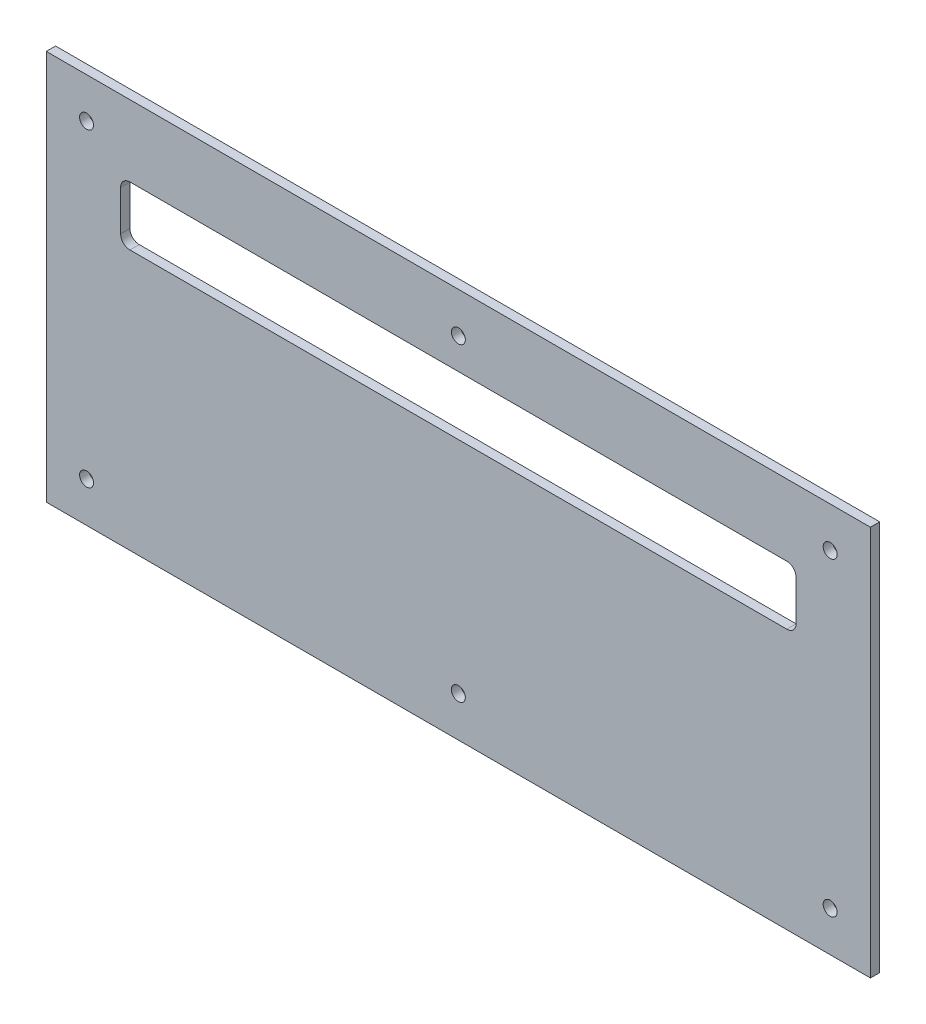
ISO-10303-21;
HEADER;
FILE_DESCRIPTION(('STEP AP214'),'2;1');
FILE_NAME('part.step','',(''),(''),'','','');
FILE_SCHEMA(('AUTOMOTIVE_DESIGN { 1 0 10303 214 1 1 1 1 }'));
ENDSEC;
DATA;
#1=APPLICATION_CONTEXT('core data for automotive mechanical design processes');
#2=APPLICATION_PROTOCOL_DEFINITION('international standard','automotive_design',2000,#1);
#3=PRODUCT_CONTEXT('',#1,'mechanical');
#4=PRODUCT('Part','Part','',(#3));
#5=PRODUCT_RELATED_PRODUCT_CATEGORY('part','',(#4));
#6=PRODUCT_DEFINITION_FORMATION('','',#4);
#7=PRODUCT_DEFINITION_CONTEXT('part definition',#1,'design');
#8=PRODUCT_DEFINITION('design','',#6,#7);
#9=PRODUCT_DEFINITION_SHAPE('','',#8);
#10=(LENGTH_UNIT() NAMED_UNIT(*) SI_UNIT(.MILLI.,.METRE.));
#11=(NAMED_UNIT(*) PLANE_ANGLE_UNIT() SI_UNIT($,.RADIAN.));
#12=(NAMED_UNIT(*) SI_UNIT($,.STERADIAN.) SOLID_ANGLE_UNIT());
#13=UNCERTAINTY_MEASURE_WITH_UNIT(LENGTH_MEASURE(1.E-05),#10,'distance_accuracy_value','');
#14=(GEOMETRIC_REPRESENTATION_CONTEXT(3) GLOBAL_UNCERTAINTY_ASSIGNED_CONTEXT((#13)) GLOBAL_UNIT_ASSIGNED_CONTEXT((#10,
#11,#12)) REPRESENTATION_CONTEXT('',''));
#15=CARTESIAN_POINT('',(0.,0.,0.));
#16=DIRECTION('',(0.,0.,1.));
#17=DIRECTION('',(1.,0.,0.));
#18=AXIS2_PLACEMENT_3D('',#15,#16,#17);
#19=CARTESIAN_POINT('',(23.,123.,-3.00000000000001));
#20=DIRECTION('',(-1.,0.,0.));
#21=DIRECTION('',(0.,0.,1.));
#22=AXIS2_PLACEMENT_3D('',#19,#20,#21);
#23=PLANE('',#22);
#24=DIRECTION('',(0.,-1.,0.));
#25=VECTOR('',#24,1.);
#26=CARTESIAN_POINT('',(23.,123.,0.));
#27=LINE('',#26,#25);
#28=CARTESIAN_POINT('',(23.,123.,0.));
#29=VERTEX_POINT('',#28);
#30=CARTESIAN_POINT('',(23.,-2.99999999999886,0.));
#31=VERTEX_POINT('',#30);
#32=EDGE_CURVE('E146',#29,#31,#27,.T.);
#33=ORIENTED_EDGE('',*,*,#32,.T.);
#34=DIRECTION('',(0.,0.,1.));
#35=VECTOR('',#34,1.);
#36=CARTESIAN_POINT('',(23.,-2.99999999999886,-3.00000000000001));
#37=LINE('',#36,#35);
#38=CARTESIAN_POINT('',(23.,-2.99999999999886,-3.00000000000001));
#39=VERTEX_POINT('',#38);
#40=EDGE_CURVE('E127',#39,#31,#37,.T.);
#41=ORIENTED_EDGE('',*,*,#40,.F.);
#42=DIRECTION('',(0.,-1.,0.));
#43=VECTOR('',#42,1.);
#44=CARTESIAN_POINT('',(23.,123.,-3.00000000000001));
#45=LINE('',#44,#43);
#46=CARTESIAN_POINT('',(23.,123.,-3.00000000000001));
#47=VERTEX_POINT('',#46);
#48=EDGE_CURVE('E134',#47,#39,#45,.T.);
#49=ORIENTED_EDGE('',*,*,#48,.F.);
#50=DIRECTION('',(0.,0.,1.));
#51=VECTOR('',#50,1.);
#52=CARTESIAN_POINT('',(23.,123.,-3.00000000000001));
#53=LINE('',#52,#51);
#54=EDGE_CURVE('E217',#47,#29,#53,.T.);
#55=ORIENTED_EDGE('',*,*,#54,.T.);
#56=EDGE_LOOP('',(#33,#41,#49,#55));
#57=FACE_BOUND('',#56,.T.);
#58=ADVANCED_FACE('F33',(#57),#23,.F.);
#59=CARTESIAN_POINT('',(23.,-2.99999999999886,-3.00000000000001));
#60=DIRECTION('',(0.,1.,0.));
#61=DIRECTION('',(-1.,0.,0.));
#62=AXIS2_PLACEMENT_3D('',#59,#60,#61);
#63=PLANE('',#62);
#64=DIRECTION('',(-1.,0.,0.));
#65=VECTOR('',#64,1.);
#66=CARTESIAN_POINT('',(23.,-2.99999999999886,0.));
#67=LINE('',#66,#65);
#68=CARTESIAN_POINT('',(-243.,-2.99999999999923,1.14860437237702E-13));
#69=VERTEX_POINT('',#68);
#70=EDGE_CURVE('E219',#31,#69,#67,.T.);
#71=ORIENTED_EDGE('',*,*,#70,.T.);
#72=DIRECTION('',(0.,0.,1.));
#73=VECTOR('',#72,1.);
#74=CARTESIAN_POINT('',(-243.,-2.99999999999923,-2.99999999999988));
#75=LINE('',#74,#73);
#76=CARTESIAN_POINT('',(-243.,-2.99999999999923,-2.99999999999988));
#77=VERTEX_POINT('',#76);
#78=EDGE_CURVE('E130',#77,#69,#75,.T.);
#79=ORIENTED_EDGE('',*,*,#78,.F.);
#80=DIRECTION('',(-1.,0.,0.));
#81=VECTOR('',#80,1.);
#82=CARTESIAN_POINT('',(23.,-2.99999999999886,-3.00000000000001));
#83=LINE('',#82,#81);
#84=EDGE_CURVE('E123',#39,#77,#83,.T.);
#85=ORIENTED_EDGE('',*,*,#84,.F.);
#86=ORIENTED_EDGE('',*,*,#40,.T.);
#87=EDGE_LOOP('',(#71,#79,#85,#86));
#88=FACE_BOUND('',#87,.T.);
#89=ADVANCED_FACE('F125',(#88),#63,.F.);
#90=CARTESIAN_POINT('',(-243.,123.,-2.99999999999988));
#91=DIRECTION('',(1.,0.,0.));
#92=DIRECTION('',(0.,1.,0.));
#93=AXIS2_PLACEMENT_3D('',#90,#91,#92);
#94=PLANE('',#93);
#95=DIRECTION('',(0.,1.,0.));
#96=VECTOR('',#95,1.);
#97=CARTESIAN_POINT('',(-243.,123.,1.14860437237702E-13));
#98=LINE('',#97,#96);
#99=CARTESIAN_POINT('',(-243.,123.,1.14860437237702E-13));
#100=VERTEX_POINT('',#99);
#101=EDGE_CURVE('E221',#69,#100,#98,.T.);
#102=ORIENTED_EDGE('',*,*,#101,.T.);
#103=DIRECTION('',(0.,0.,1.));
#104=VECTOR('',#103,1.);
#105=CARTESIAN_POINT('',(-243.,123.,-2.99999999999988));
#106=LINE('',#105,#104);
#107=CARTESIAN_POINT('',(-243.,123.,-2.99999999999988));
#108=VERTEX_POINT('',#107);
#109=EDGE_CURVE('E152',#108,#100,#106,.T.);
#110=ORIENTED_EDGE('',*,*,#109,.F.);
#111=DIRECTION('',(0.,1.,0.));
#112=VECTOR('',#111,1.);
#113=CARTESIAN_POINT('',(-243.,123.,-2.99999999999988));
#114=LINE('',#113,#112);
#115=EDGE_CURVE('E133',#77,#108,#114,.T.);
#116=ORIENTED_EDGE('',*,*,#115,.F.);
#117=ORIENTED_EDGE('',*,*,#78,.T.);
#118=EDGE_LOOP('',(#102,#110,#116,#117));
#119=FACE_BOUND('',#118,.T.);
#120=ADVANCED_FACE('F231',(#119),#94,.F.);
#121=CARTESIAN_POINT('',(23.,123.,-3.00000000000001));
#122=DIRECTION('',(0.,-1.,0.));
#123=DIRECTION('',(0.,0.,-1.));
#124=AXIS2_PLACEMENT_3D('',#121,#122,#123);
#125=PLANE('',#124);
#126=DIRECTION('',(1.,0.,0.));
#127=VECTOR('',#126,1.);
#128=CARTESIAN_POINT('',(23.,123.,0.));
#129=LINE('',#128,#127);
#130=EDGE_CURVE('E143',#100,#29,#129,.T.);
#131=ORIENTED_EDGE('',*,*,#130,.T.);
#132=ORIENTED_EDGE('',*,*,#54,.F.);
#133=DIRECTION('',(1.,0.,0.));
#134=VECTOR('',#133,1.);
#135=CARTESIAN_POINT('',(23.,123.,-3.00000000000001));
#136=LINE('',#135,#134);
#137=EDGE_CURVE('E139',#108,#47,#136,.T.);
#138=ORIENTED_EDGE('',*,*,#137,.F.);
#139=ORIENTED_EDGE('',*,*,#109,.T.);
#140=EDGE_LOOP('',(#131,#132,#138,#139));
#141=FACE_BOUND('',#140,.T.);
#142=ADVANCED_FACE('F228',(#141),#125,.F.);
#143=CARTESIAN_POINT('',(0.,0.,-3.));
#144=DIRECTION('',(0.,0.,-1.));
#145=DIRECTION('',(-1.,0.,0.));
#146=AXIS2_PLACEMENT_3D('',#143,#144,#145);
#147=PLANE('',#146);
#148=CARTESIAN_POINT('',(-230.,10.0000000000008,-2.99999999999989));
#149=DIRECTION('',(0.,0.,-1.));
#150=DIRECTION('',(-1.,0.,0.));
#151=AXIS2_PLACEMENT_3D('',#148,#149,#150);
#152=CIRCLE('',#151,2.24999999999995);
#153=CARTESIAN_POINT('',(-232.25,10.0000000000008,-2.99999999999989));
#154=VERTEX_POINT('',#153);
#155=EDGE_CURVE('E307',#154,#154,#152,.T.);
#156=ORIENTED_EDGE('',*,*,#155,.F.);
#157=EDGE_LOOP('',(#156));
#158=FACE_BOUND('',#157,.T.);
#159=CARTESIAN_POINT('',(-110.,10.0000000000008,-2.99999999999995));
#160=DIRECTION('',(0.,0.,-1.));
#161=DIRECTION('',(-1.,0.,0.));
#162=AXIS2_PLACEMENT_3D('',#159,#160,#161);
#163=CIRCLE('',#162,2.25000000000001);
#164=CARTESIAN_POINT('',(-112.25,10.0000000000008,-2.99999999999995));
#165=VERTEX_POINT('',#164);
#166=EDGE_CURVE('E301',#165,#165,#163,.T.);
#167=ORIENTED_EDGE('',*,*,#166,.F.);
#168=EDGE_LOOP('',(#167));
#169=FACE_BOUND('',#168,.T.);
#170=CARTESIAN_POINT('',(9.9999999999999,10.0000000000011,-3.));
#171=DIRECTION('',(0.,0.,-1.));
#172=DIRECTION('',(-1.,0.,0.));
#173=AXIS2_PLACEMENT_3D('',#170,#171,#172);
#174=CIRCLE('',#173,2.25000000000001);
#175=CARTESIAN_POINT('',(7.74999999999989,10.0000000000011,-3.));
#176=VERTEX_POINT('',#175);
#177=EDGE_CURVE('E295',#176,#176,#174,.T.);
#178=ORIENTED_EDGE('',*,*,#177,.F.);
#179=EDGE_LOOP('',(#178));
#180=FACE_BOUND('',#179,.T.);
#181=CARTESIAN_POINT('',(9.99999999999987,110.,-3.));
#182=DIRECTION('',(0.,0.,-1.));
#183=DIRECTION('',(-1.,0.,0.));
#184=AXIS2_PLACEMENT_3D('',#181,#182,#183);
#185=CIRCLE('',#184,2.25000000000001);
#186=CARTESIAN_POINT('',(7.74999999999986,110.,-3.));
#187=VERTEX_POINT('',#186);
#188=EDGE_CURVE('E289',#187,#187,#185,.T.);
#189=ORIENTED_EDGE('',*,*,#188,.F.);
#190=EDGE_LOOP('',(#189));
#191=FACE_BOUND('',#190,.T.);
#192=CARTESIAN_POINT('',(-110.,110.,-2.99999999999995));
#193=DIRECTION('',(0.,0.,-1.));
#194=DIRECTION('',(-1.,0.,0.));
#195=AXIS2_PLACEMENT_3D('',#192,#193,#194);
#196=CIRCLE('',#195,2.25000000000003);
#197=CARTESIAN_POINT('',(-112.25,110.,-2.99999999999995));
#198=VERTEX_POINT('',#197);
#199=EDGE_CURVE('E283',#198,#198,#196,.T.);
#200=ORIENTED_EDGE('',*,*,#199,.F.);
#201=EDGE_LOOP('',(#200));
#202=FACE_BOUND('',#201,.T.);
#203=CARTESIAN_POINT('',(-230.,110.,-2.99999999999989));
#204=DIRECTION('',(0.,0.,-1.));
#205=DIRECTION('',(-1.,0.,0.));
#206=AXIS2_PLACEMENT_3D('',#203,#204,#205);
#207=CIRCLE('',#206,2.24999999999995);
#208=CARTESIAN_POINT('',(-232.25,110.,-2.99999999999989));
#209=VERTEX_POINT('',#208);
#210=EDGE_CURVE('E277',#209,#209,#207,.T.);
#211=ORIENTED_EDGE('',*,*,#210,.F.);
#212=EDGE_LOOP('',(#211));
#213=FACE_BOUND('',#212,.T.);
#214=DIRECTION('',(0.,1.,0.));
#215=VECTOR('',#214,1.);
#216=CARTESIAN_POINT('',(-219.,81.,-3.00000000000001));
#217=LINE('',#216,#215);
#218=CARTESIAN_POINT('',(-219.,84.,-3.00000000000001));
#219=VERTEX_POINT('',#218);
#220=CARTESIAN_POINT('',(-219.,97.,-3.00000000000001));
#221=VERTEX_POINT('',#220);
#222=EDGE_CURVE('E204',#219,#221,#217,.T.);
#223=ORIENTED_EDGE('',*,*,#222,.F.);
#224=CARTESIAN_POINT('',(-216.,84.,-2.9999999999999));
#225=DIRECTION('',(0.,0.,-1.));
#226=DIRECTION('',(-1.,0.,0.));
#227=AXIS2_PLACEMENT_3D('',#224,#225,#226);
#228=CIRCLE('',#227,3.);
#229=CARTESIAN_POINT('',(-216.,81.,-3.00000000000001));
#230=VERTEX_POINT('',#229);
#231=EDGE_CURVE('E171',#219,#230,#228,.F.);
#232=ORIENTED_EDGE('',*,*,#231,.T.);
#233=DIRECTION('',(1.,0.,0.));
#234=VECTOR('',#233,1.);
#235=CARTESIAN_POINT('',(-220.,81.,-3.00000000000001));
#236=LINE('',#235,#234);
#237=CARTESIAN_POINT('',(-4.,81.,-3.00000000000001));
#238=VERTEX_POINT('',#237);
#239=EDGE_CURVE('E208',#230,#238,#236,.T.);
#240=ORIENTED_EDGE('',*,*,#239,.T.);
#241=CARTESIAN_POINT('',(-4.,84.,-3.));
#242=DIRECTION('',(0.,0.,-1.));
#243=DIRECTION('',(-1.,0.,0.));
#244=AXIS2_PLACEMENT_3D('',#241,#242,#243);
#245=CIRCLE('',#244,3.);
#246=CARTESIAN_POINT('',(-1.,84.,-3.00000000000001));
#247=VERTEX_POINT('',#246);
#248=EDGE_CURVE('E11',#238,#247,#245,.F.);
#249=ORIENTED_EDGE('',*,*,#248,.T.);
#250=DIRECTION('',(0.,-1.,0.));
#251=VECTOR('',#250,1.);
#252=CARTESIAN_POINT('',(-1.,100.,-3.));
#253=LINE('',#252,#251);
#254=CARTESIAN_POINT('',(-1.,97.,-3.));
#255=VERTEX_POINT('',#254);
#256=EDGE_CURVE('E199',#255,#247,#253,.T.);
#257=ORIENTED_EDGE('',*,*,#256,.F.);
#258=CARTESIAN_POINT('',(-4.,97.,-3.));
#259=DIRECTION('',(0.,0.,-1.));
#260=DIRECTION('',(-1.,0.,0.));
#261=AXIS2_PLACEMENT_3D('',#258,#259,#260);
#262=CIRCLE('',#261,3.);
#263=CARTESIAN_POINT('',(-4.,100.,-3.00000000000001));
#264=VERTEX_POINT('',#263);
#265=EDGE_CURVE('E54',#255,#264,#262,.F.);
#266=ORIENTED_EDGE('',*,*,#265,.T.);
#267=DIRECTION('',(-1.,0.,0.));
#268=VECTOR('',#267,1.);
#269=CARTESIAN_POINT('',(0.,100.,-3.00000000000001));
#270=LINE('',#269,#268);
#271=CARTESIAN_POINT('',(-216.,100.,-3.00000000000001));
#272=VERTEX_POINT('',#271);
#273=EDGE_CURVE('E210',#264,#272,#270,.T.);
#274=ORIENTED_EDGE('',*,*,#273,.T.);
#275=CARTESIAN_POINT('',(-216.,97.,-2.9999999999999));
#276=DIRECTION('',(0.,0.,-1.));
#277=DIRECTION('',(-1.,0.,0.));
#278=AXIS2_PLACEMENT_3D('',#275,#276,#277);
#279=CIRCLE('',#278,3.);
#280=EDGE_CURVE('E177',#272,#221,#279,.F.);
#281=ORIENTED_EDGE('',*,*,#280,.T.);
#282=EDGE_LOOP('',(#223,#232,#240,#249,#257,#266,#274,#281));
#283=FACE_BOUND('',#282,.T.);
#284=ORIENTED_EDGE('',*,*,#48,.T.);
#285=ORIENTED_EDGE('',*,*,#84,.T.);
#286=ORIENTED_EDGE('',*,*,#115,.T.);
#287=ORIENTED_EDGE('',*,*,#137,.T.);
#288=EDGE_LOOP('',(#284,#285,#286,#287));
#289=FACE_BOUND('',#288,.T.);
#290=ADVANCED_FACE('F137',(#158,#169,#180,#191,#202,#213,#283,#289),#147,.T.);
#291=CARTESIAN_POINT('',(0.,0.,0.));
#292=DIRECTION('',(0.,0.,-1.));
#293=DIRECTION('',(-1.,0.,0.));
#294=AXIS2_PLACEMENT_3D('',#291,#292,#293);
#295=PLANE('',#294);
#296=CARTESIAN_POINT('',(-230.,10.0000000000008,2.34621350125863E-13));
#297=DIRECTION('',(0.,0.,-1.));
#298=DIRECTION('',(-1.,0.,0.));
#299=AXIS2_PLACEMENT_3D('',#296,#297,#298);
#300=CIRCLE('',#299,2.24999999999995);
#301=CARTESIAN_POINT('',(-232.25,10.0000000000008,2.35684872692879E-13));
#302=VERTEX_POINT('',#301);
#303=EDGE_CURVE('E304',#302,#302,#300,.T.);
#304=ORIENTED_EDGE('',*,*,#303,.T.);
#305=EDGE_LOOP('',(#304));
#306=FACE_BOUND('',#305,.T.);
#307=CARTESIAN_POINT('',(-110.,10.0000000000008,1.77809156287623E-13));
#308=DIRECTION('',(0.,0.,-1.));
#309=DIRECTION('',(-1.,0.,0.));
#310=AXIS2_PLACEMENT_3D('',#307,#308,#309);
#311=CIRCLE('',#310,2.25000000000001);
#312=CARTESIAN_POINT('',(-112.25,10.0000000000008,1.78872678854639E-13));
#313=VERTEX_POINT('',#312);
#314=EDGE_CURVE('E298',#313,#313,#311,.T.);
#315=ORIENTED_EDGE('',*,*,#314,.T.);
#316=EDGE_LOOP('',(#315));
#317=FACE_BOUND('',#316,.T.);
#318=CARTESIAN_POINT('',(9.9999999999999,10.0000000000011,1.20996962449382E-13));
#319=DIRECTION('',(0.,0.,-1.));
#320=DIRECTION('',(-1.,0.,0.));
#321=AXIS2_PLACEMENT_3D('',#318,#319,#320);
#322=CIRCLE('',#321,2.25000000000001);
#323=CARTESIAN_POINT('',(7.74999999999989,10.0000000000011,1.22060485016398E-13));
#324=VERTEX_POINT('',#323);
#325=EDGE_CURVE('E292',#324,#324,#322,.T.);
#326=ORIENTED_EDGE('',*,*,#325,.T.);
#327=EDGE_LOOP('',(#326));
#328=FACE_BOUND('',#327,.T.);
#329=CARTESIAN_POINT('',(9.99999999999987,110.,1.20996962449382E-13));
#330=DIRECTION('',(0.,0.,-1.));
#331=DIRECTION('',(-1.,0.,0.));
#332=AXIS2_PLACEMENT_3D('',#329,#330,#331);
#333=CIRCLE('',#332,2.25000000000001);
#334=CARTESIAN_POINT('',(7.74999999999986,110.,1.22060485016398E-13));
#335=VERTEX_POINT('',#334);
#336=EDGE_CURVE('E286',#335,#335,#333,.T.);
#337=ORIENTED_EDGE('',*,*,#336,.T.);
#338=EDGE_LOOP('',(#337));
#339=FACE_BOUND('',#338,.T.);
#340=CARTESIAN_POINT('',(-110.,110.,1.77809156287623E-13));
#341=DIRECTION('',(0.,0.,-1.));
#342=DIRECTION('',(-1.,0.,0.));
#343=AXIS2_PLACEMENT_3D('',#340,#341,#342);
#344=CIRCLE('',#343,2.25000000000003);
#345=CARTESIAN_POINT('',(-112.25,110.,1.78872678854639E-13));
#346=VERTEX_POINT('',#345);
#347=EDGE_CURVE('E280',#346,#346,#344,.T.);
#348=ORIENTED_EDGE('',*,*,#347,.T.);
#349=EDGE_LOOP('',(#348));
#350=FACE_BOUND('',#349,.T.);
#351=CARTESIAN_POINT('',(-230.,110.,2.34621350125863E-13));
#352=DIRECTION('',(0.,0.,-1.));
#353=DIRECTION('',(-1.,0.,0.));
#354=AXIS2_PLACEMENT_3D('',#351,#352,#353);
#355=CIRCLE('',#354,2.24999999999995);
#356=CARTESIAN_POINT('',(-232.25,110.,2.35684872692879E-13));
#357=VERTEX_POINT('',#356);
#358=EDGE_CURVE('E274',#357,#357,#355,.T.);
#359=ORIENTED_EDGE('',*,*,#358,.T.);
#360=EDGE_LOOP('',(#359));
#361=FACE_BOUND('',#360,.T.);
#362=DIRECTION('',(1.,0.,0.));
#363=VECTOR('',#362,1.);
#364=CARTESIAN_POINT('',(-220.,81.,0.));
#365=LINE('',#364,#363);
#366=CARTESIAN_POINT('',(-216.,81.,0.));
#367=VERTEX_POINT('',#366);
#368=CARTESIAN_POINT('',(-4.,81.,0.));
#369=VERTEX_POINT('',#368);
#370=EDGE_CURVE('E187',#367,#369,#365,.T.);
#371=ORIENTED_EDGE('',*,*,#370,.F.);
#372=CARTESIAN_POINT('',(-216.,84.,1.02098166433513E-13));
#373=DIRECTION('',(0.,0.,-1.));
#374=DIRECTION('',(-1.,0.,0.));
#375=AXIS2_PLACEMENT_3D('',#372,#373,#374);
#376=CIRCLE('',#375,3.);
#377=CARTESIAN_POINT('',(-219.,84.,0.));
#378=VERTEX_POINT('',#377);
#379=EDGE_CURVE('E173',#367,#378,#376,.T.);
#380=ORIENTED_EDGE('',*,*,#379,.T.);
#381=DIRECTION('',(0.,-1.,0.));
#382=VECTOR('',#381,1.);
#383=CARTESIAN_POINT('',(-219.,100.,0.));
#384=LINE('',#383,#382);
#385=CARTESIAN_POINT('',(-219.,97.,0.));
#386=VERTEX_POINT('',#385);
#387=EDGE_CURVE('E273',#386,#378,#384,.T.);
#388=ORIENTED_EDGE('',*,*,#387,.F.);
#389=CARTESIAN_POINT('',(-216.,97.,1.02098166433513E-13));
#390=DIRECTION('',(0.,0.,-1.));
#391=DIRECTION('',(-1.,0.,0.));
#392=AXIS2_PLACEMENT_3D('',#389,#390,#391);
#393=CIRCLE('',#392,3.);
#394=CARTESIAN_POINT('',(-216.,100.,0.));
#395=VERTEX_POINT('',#394);
#396=EDGE_CURVE('E175',#386,#395,#393,.T.);
#397=ORIENTED_EDGE('',*,*,#396,.T.);
#398=DIRECTION('',(-1.,0.,0.));
#399=VECTOR('',#398,1.);
#400=CARTESIAN_POINT('',(0.,100.,0.));
#401=LINE('',#400,#399);
#402=CARTESIAN_POINT('',(-4.,100.,0.));
#403=VERTEX_POINT('',#402);
#404=EDGE_CURVE('E198',#403,#395,#401,.T.);
#405=ORIENTED_EDGE('',*,*,#404,.F.);
#406=CARTESIAN_POINT('',(-4.,97.,0.));
#407=DIRECTION('',(0.,0.,-1.));
#408=DIRECTION('',(-1.,0.,0.));
#409=AXIS2_PLACEMENT_3D('',#406,#407,#408);
#410=CIRCLE('',#409,3.);
#411=CARTESIAN_POINT('',(-1.,97.,0.));
#412=VERTEX_POINT('',#411);
#413=EDGE_CURVE('E180',#403,#412,#410,.T.);
#414=ORIENTED_EDGE('',*,*,#413,.T.);
#415=DIRECTION('',(0.,1.,0.));
#416=VECTOR('',#415,1.);
#417=CARTESIAN_POINT('',(-1.,81.,0.));
#418=LINE('',#417,#416);
#419=CARTESIAN_POINT('',(-1.,84.,0.));
#420=VERTEX_POINT('',#419);
#421=EDGE_CURVE('E190',#420,#412,#418,.T.);
#422=ORIENTED_EDGE('',*,*,#421,.F.);
#423=CARTESIAN_POINT('',(-4.,84.,0.));
#424=DIRECTION('',(0.,0.,-1.));
#425=DIRECTION('',(-1.,0.,0.));
#426=AXIS2_PLACEMENT_3D('',#423,#424,#425);
#427=CIRCLE('',#426,3.);
#428=EDGE_CURVE('E41',#420,#369,#427,.T.);
#429=ORIENTED_EDGE('',*,*,#428,.T.);
#430=EDGE_LOOP('',(#371,#380,#388,#397,#405,#414,#422,#429));
#431=FACE_BOUND('',#430,.T.);
#432=ORIENTED_EDGE('',*,*,#32,.F.);
#433=ORIENTED_EDGE('',*,*,#130,.F.);
#434=ORIENTED_EDGE('',*,*,#101,.F.);
#435=ORIENTED_EDGE('',*,*,#70,.F.);
#436=EDGE_LOOP('',(#432,#433,#434,#435));
#437=FACE_BOUND('',#436,.T.);
#438=ADVANCED_FACE('F185',(#306,#317,#328,#339,#350,#361,#431,#437),#295,.F.);
#439=CARTESIAN_POINT('',(-220.,81.,-3.00000000000001));
#440=DIRECTION('',(0.,-1.,0.));
#441=DIRECTION('',(0.,0.,-1.));
#442=AXIS2_PLACEMENT_3D('',#439,#440,#441);
#443=PLANE('',#442);
#444=ORIENTED_EDGE('',*,*,#239,.F.);
#445=DIRECTION('',(0.,0.,-1.));
#446=VECTOR('',#445,1.);
#447=CARTESIAN_POINT('',(-216.,81.,-3.00000000000001));
#448=LINE('',#447,#446);
#449=EDGE_CURVE('E160',#230,#367,#448,.F.);
#450=ORIENTED_EDGE('',*,*,#449,.T.);
#451=ORIENTED_EDGE('',*,*,#370,.T.);
#452=DIRECTION('',(0.,0.,1.));
#453=VECTOR('',#452,1.);
#454=CARTESIAN_POINT('',(-4.,81.,-3.00000000000001));
#455=LINE('',#454,#453);
#456=EDGE_CURVE('E158',#369,#238,#455,.F.);
#457=ORIENTED_EDGE('',*,*,#456,.T.);
#458=EDGE_LOOP('',(#444,#450,#451,#457));
#459=FACE_BOUND('',#458,.T.);
#460=ADVANCED_FACE('F196',(#459),#443,.F.);
#461=CARTESIAN_POINT('',(0.,100.,-3.00000000000001));
#462=DIRECTION('',(0.,1.,0.));
#463=DIRECTION('',(0.,0.,1.));
#464=AXIS2_PLACEMENT_3D('',#461,#462,#463);
#465=PLANE('',#464);
#466=ORIENTED_EDGE('',*,*,#404,.T.);
#467=DIRECTION('',(0.,0.,1.));
#468=VECTOR('',#467,1.);
#469=CARTESIAN_POINT('',(-216.,100.,-3.00000000000001));
#470=LINE('',#469,#468);
#471=EDGE_CURVE('E164',#395,#272,#470,.F.);
#472=ORIENTED_EDGE('',*,*,#471,.T.);
#473=ORIENTED_EDGE('',*,*,#273,.F.);
#474=DIRECTION('',(0.,0.,-1.));
#475=VECTOR('',#474,1.);
#476=CARTESIAN_POINT('',(-4.,100.,-3.00000000000001));
#477=LINE('',#476,#475);
#478=EDGE_CURVE('E162',#264,#403,#477,.F.);
#479=ORIENTED_EDGE('',*,*,#478,.T.);
#480=EDGE_LOOP('',(#466,#472,#473,#479));
#481=FACE_BOUND('',#480,.T.);
#482=ADVANCED_FACE('F264',(#481),#465,.F.);
#483=CARTESIAN_POINT('',(-1.,0.,0.));
#484=DIRECTION('',(-1.,0.,0.));
#485=DIRECTION('',(0.,0.,1.));
#486=AXIS2_PLACEMENT_3D('',#483,#484,#485);
#487=PLANE('',#486);
#488=ORIENTED_EDGE('',*,*,#421,.T.);
#489=DIRECTION('',(0.,0.,-1.));
#490=VECTOR('',#489,1.);
#491=CARTESIAN_POINT('',(-1.,97.,0.));
#492=LINE('',#491,#490);
#493=EDGE_CURVE('E169',#412,#255,#492,.T.);
#494=ORIENTED_EDGE('',*,*,#493,.T.);
#495=ORIENTED_EDGE('',*,*,#256,.T.);
#496=DIRECTION('',(0.,0.,1.));
#497=VECTOR('',#496,1.);
#498=CARTESIAN_POINT('',(-1.,84.,0.));
#499=LINE('',#498,#497);
#500=EDGE_CURVE('E166',#247,#420,#499,.T.);
#501=ORIENTED_EDGE('',*,*,#500,.T.);
#502=EDGE_LOOP('',(#488,#494,#495,#501));
#503=FACE_BOUND('',#502,.T.);
#504=ADVANCED_FACE('F202',(#503),#487,.T.);
#505=CARTESIAN_POINT('',(-219.,0.,0.));
#506=DIRECTION('',(1.,0.,0.));
#507=DIRECTION('',(0.,0.,-1.));
#508=AXIS2_PLACEMENT_3D('',#505,#506,#507);
#509=PLANE('',#508);
#510=ORIENTED_EDGE('',*,*,#387,.T.);
#511=DIRECTION('',(0.,0.,-1.));
#512=VECTOR('',#511,1.);
#513=CARTESIAN_POINT('',(-219.,84.,0.));
#514=LINE('',#513,#512);
#515=EDGE_CURVE('E150',#378,#219,#514,.T.);
#516=ORIENTED_EDGE('',*,*,#515,.T.);
#517=ORIENTED_EDGE('',*,*,#222,.T.);
#518=DIRECTION('',(0.,0.,1.));
#519=VECTOR('',#518,1.);
#520=CARTESIAN_POINT('',(-219.,97.,0.));
#521=LINE('',#520,#519);
#522=EDGE_CURVE('E147',#221,#386,#521,.T.);
#523=ORIENTED_EDGE('',*,*,#522,.T.);
#524=EDGE_LOOP('',(#510,#516,#517,#523));
#525=FACE_BOUND('',#524,.T.);
#526=ADVANCED_FACE('F249',(#525),#509,.T.);
#527=CARTESIAN_POINT('',(-216.,84.,0.));
#528=DIRECTION('',(0.,0.,-1.));
#529=DIRECTION('',(-1.,0.,0.));
#530=AXIS2_PLACEMENT_3D('',#527,#528,#529);
#531=CYLINDRICAL_SURFACE('',#530,3.);
#532=ORIENTED_EDGE('',*,*,#379,.F.);
#533=ORIENTED_EDGE('',*,*,#449,.F.);
#534=ORIENTED_EDGE('',*,*,#231,.F.);
#535=ORIENTED_EDGE('',*,*,#515,.F.);
#536=EDGE_LOOP('',(#532,#533,#534,#535));
#537=FACE_BOUND('',#536,.T.);
#538=ADVANCED_FACE('F245',(#537),#531,.F.);
#539=CARTESIAN_POINT('',(-216.,97.,0.));
#540=DIRECTION('',(0.,0.,1.));
#541=DIRECTION('',(1.,0.,0.));
#542=AXIS2_PLACEMENT_3D('',#539,#540,#541);
#543=CYLINDRICAL_SURFACE('',#542,3.);
#544=ORIENTED_EDGE('',*,*,#280,.F.);
#545=ORIENTED_EDGE('',*,*,#471,.F.);
#546=ORIENTED_EDGE('',*,*,#396,.F.);
#547=ORIENTED_EDGE('',*,*,#522,.F.);
#548=EDGE_LOOP('',(#544,#545,#546,#547));
#549=FACE_BOUND('',#548,.T.);
#550=ADVANCED_FACE('F248',(#549),#543,.F.);
#551=CARTESIAN_POINT('',(-4.,97.,0.));
#552=DIRECTION('',(0.,0.,-1.));
#553=DIRECTION('',(-1.,0.,0.));
#554=AXIS2_PLACEMENT_3D('',#551,#552,#553);
#555=CYLINDRICAL_SURFACE('',#554,3.);
#556=ORIENTED_EDGE('',*,*,#413,.F.);
#557=ORIENTED_EDGE('',*,*,#478,.F.);
#558=ORIENTED_EDGE('',*,*,#265,.F.);
#559=ORIENTED_EDGE('',*,*,#493,.F.);
#560=EDGE_LOOP('',(#556,#557,#558,#559));
#561=FACE_BOUND('',#560,.T.);
#562=ADVANCED_FACE('F252',(#561),#555,.F.);
#563=CARTESIAN_POINT('',(-4.,84.,0.));
#564=DIRECTION('',(0.,0.,1.));
#565=DIRECTION('',(1.,0.,0.));
#566=AXIS2_PLACEMENT_3D('',#563,#564,#565);
#567=CYLINDRICAL_SURFACE('',#566,3.);
#568=ORIENTED_EDGE('',*,*,#248,.F.);
#569=ORIENTED_EDGE('',*,*,#456,.F.);
#570=ORIENTED_EDGE('',*,*,#428,.F.);
#571=ORIENTED_EDGE('',*,*,#500,.F.);
#572=EDGE_LOOP('',(#568,#569,#570,#571));
#573=FACE_BOUND('',#572,.T.);
#574=ADVANCED_FACE('F35',(#573),#567,.F.);
#575=CARTESIAN_POINT('',(-230.,110.,2.34621350125863E-13));
#576=DIRECTION('',(0.,0.,-1.));
#577=DIRECTION('',(-1.,0.,0.));
#578=AXIS2_PLACEMENT_3D('',#575,#576,#577);
#579=CYLINDRICAL_SURFACE('',#578,2.24999999999995);
#580=ORIENTED_EDGE('',*,*,#358,.F.);
#581=EDGE_LOOP('',(#580));
#582=FACE_BOUND('',#581,.T.);
#583=ORIENTED_EDGE('',*,*,#210,.T.);
#584=EDGE_LOOP('',(#583));
#585=FACE_BOUND('',#584,.T.);
#586=ADVANCED_FACE('F258',(#582,#585),#579,.F.);
#587=CARTESIAN_POINT('',(-110.,110.,1.77809156287623E-13));
#588=DIRECTION('',(0.,0.,-1.));
#589=DIRECTION('',(-1.,0.,0.));
#590=AXIS2_PLACEMENT_3D('',#587,#588,#589);
#591=CYLINDRICAL_SURFACE('',#590,2.25000000000003);
#592=ORIENTED_EDGE('',*,*,#347,.F.);
#593=EDGE_LOOP('',(#592));
#594=FACE_BOUND('',#593,.T.);
#595=ORIENTED_EDGE('',*,*,#199,.T.);
#596=EDGE_LOOP('',(#595));
#597=FACE_BOUND('',#596,.T.);
#598=ADVANCED_FACE('F336',(#594,#597),#591,.F.);
#599=CARTESIAN_POINT('',(9.99999999999987,110.,1.20996962449382E-13));
#600=DIRECTION('',(0.,0.,-1.));
#601=DIRECTION('',(-1.,0.,0.));
#602=AXIS2_PLACEMENT_3D('',#599,#600,#601);
#603=CYLINDRICAL_SURFACE('',#602,2.25000000000001);
#604=ORIENTED_EDGE('',*,*,#336,.F.);
#605=EDGE_LOOP('',(#604));
#606=FACE_BOUND('',#605,.T.);
#607=ORIENTED_EDGE('',*,*,#188,.T.);
#608=EDGE_LOOP('',(#607));
#609=FACE_BOUND('',#608,.T.);
#610=ADVANCED_FACE('F342',(#606,#609),#603,.F.);
#611=CARTESIAN_POINT('',(9.9999999999999,10.0000000000011,1.20996962449382E-13));
#612=DIRECTION('',(0.,0.,-1.));
#613=DIRECTION('',(-1.,0.,0.));
#614=AXIS2_PLACEMENT_3D('',#611,#612,#613);
#615=CYLINDRICAL_SURFACE('',#614,2.25000000000001);
#616=ORIENTED_EDGE('',*,*,#325,.F.);
#617=EDGE_LOOP('',(#616));
#618=FACE_BOUND('',#617,.T.);
#619=ORIENTED_EDGE('',*,*,#177,.T.);
#620=EDGE_LOOP('',(#619));
#621=FACE_BOUND('',#620,.T.);
#622=ADVANCED_FACE('F462',(#618,#621),#615,.F.);
#623=CARTESIAN_POINT('',(-110.,10.0000000000008,1.77809156287623E-13));
#624=DIRECTION('',(0.,0.,-1.));
#625=DIRECTION('',(-1.,0.,0.));
#626=AXIS2_PLACEMENT_3D('',#623,#624,#625);
#627=CYLINDRICAL_SURFACE('',#626,2.25000000000001);
#628=ORIENTED_EDGE('',*,*,#314,.F.);
#629=EDGE_LOOP('',(#628));
#630=FACE_BOUND('',#629,.T.);
#631=ORIENTED_EDGE('',*,*,#166,.T.);
#632=EDGE_LOOP('',(#631));
#633=FACE_BOUND('',#632,.T.);
#634=ADVANCED_FACE('F318',(#630,#633),#627,.F.);
#635=CARTESIAN_POINT('',(-230.,10.0000000000008,2.34621350125863E-13));
#636=DIRECTION('',(0.,0.,-1.));
#637=DIRECTION('',(-1.,0.,0.));
#638=AXIS2_PLACEMENT_3D('',#635,#636,#637);
#639=CYLINDRICAL_SURFACE('',#638,2.24999999999995);
#640=ORIENTED_EDGE('',*,*,#303,.F.);
#641=EDGE_LOOP('',(#640));
#642=FACE_BOUND('',#641,.T.);
#643=ORIENTED_EDGE('',*,*,#155,.T.);
#644=EDGE_LOOP('',(#643));
#645=FACE_BOUND('',#644,.T.);
#646=ADVANCED_FACE('F315',(#642,#645),#639,.F.);
#647=CLOSED_SHELL('',(#58,#89,#120,#142,#290,#438,#460,#482,#504,#526,#538,#550,#562,#574,#586,
#598,#610,#622,#634,#646));
#648=MANIFOLD_SOLID_BREP('B2',#647);
#649=ADVANCED_BREP_SHAPE_REPRESENTATION('',(#18,#648),#14);
#650=SHAPE_DEFINITION_REPRESENTATION(#9,#649);
ENDSEC;
END-ISO-10303-21;
